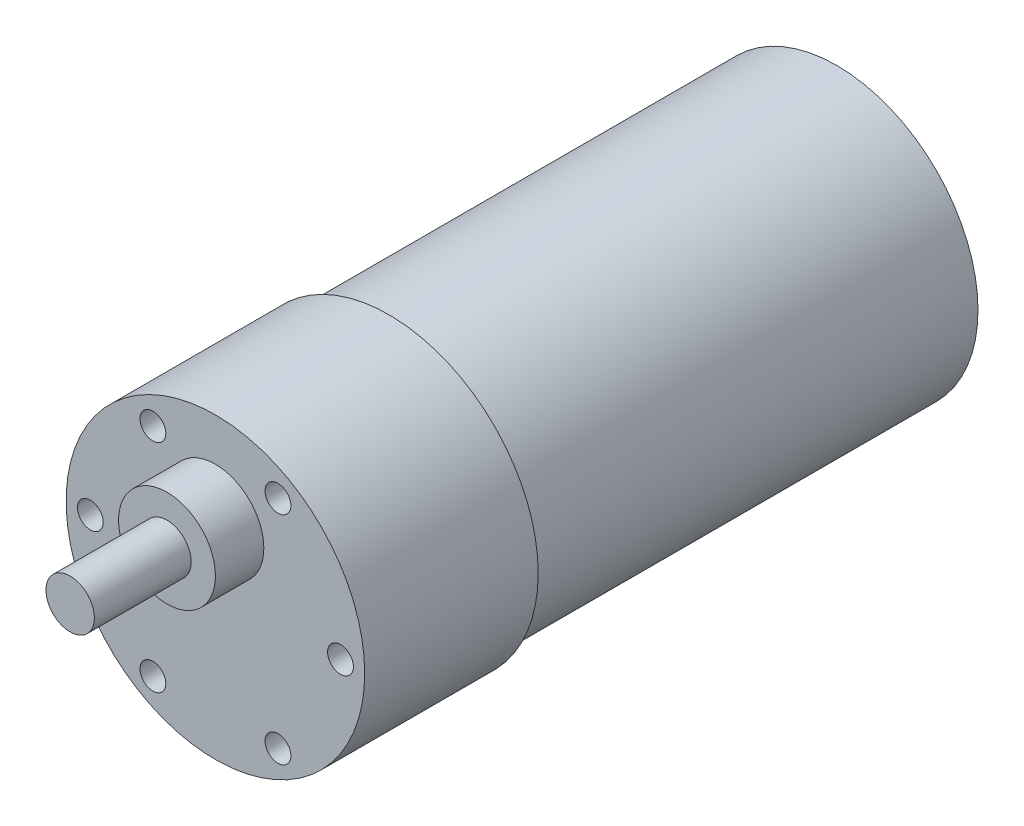
ISO-10303-21;
HEADER;
FILE_DESCRIPTION(('STEP AP214'),'2;1');
FILE_NAME('part.step','',(''),(''),'','','');
FILE_SCHEMA(('AUTOMOTIVE_DESIGN { 1 0 10303 214 1 1 1 1 }'));
ENDSEC;
DATA;
#1=APPLICATION_CONTEXT('core data for automotive mechanical design processes');
#2=APPLICATION_PROTOCOL_DEFINITION('international standard','automotive_design',2000,#1);
#3=PRODUCT_CONTEXT('',#1,'mechanical');
#4=PRODUCT('Part','Part','',(#3));
#5=PRODUCT_RELATED_PRODUCT_CATEGORY('part','',(#4));
#6=PRODUCT_DEFINITION_FORMATION('','',#4);
#7=PRODUCT_DEFINITION_CONTEXT('part definition',#1,'design');
#8=PRODUCT_DEFINITION('design','',#6,#7);
#9=PRODUCT_DEFINITION_SHAPE('','',#8);
#10=(LENGTH_UNIT() NAMED_UNIT(*) SI_UNIT(.MILLI.,.METRE.));
#11=(NAMED_UNIT(*) PLANE_ANGLE_UNIT() SI_UNIT($,.RADIAN.));
#12=(NAMED_UNIT(*) SI_UNIT($,.STERADIAN.) SOLID_ANGLE_UNIT());
#13=UNCERTAINTY_MEASURE_WITH_UNIT(LENGTH_MEASURE(1.E-05),#10,'distance_accuracy_value','');
#14=(GEOMETRIC_REPRESENTATION_CONTEXT(3) GLOBAL_UNCERTAINTY_ASSIGNED_CONTEXT((#13)) GLOBAL_UNIT_ASSIGNED_CONTEXT((#10,
#11,#12)) REPRESENTATION_CONTEXT('',''));
#15=CARTESIAN_POINT('',(0.,0.,0.));
#16=DIRECTION('',(0.,0.,1.));
#17=DIRECTION('',(1.,0.,0.));
#18=AXIS2_PLACEMENT_3D('',#15,#16,#17);
#19=CARTESIAN_POINT('',(0.,0.,-21.5));
#20=DIRECTION('',(0.,0.,1.));
#21=DIRECTION('',(1.,0.,0.));
#22=AXIS2_PLACEMENT_3D('',#19,#20,#21);
#23=CYLINDRICAL_SURFACE('',#22,18.5);
#24=CARTESIAN_POINT('',(0.,0.,-21.5));
#25=DIRECTION('',(0.,0.,1.));
#26=DIRECTION('',(1.,0.,0.));
#27=AXIS2_PLACEMENT_3D('',#24,#25,#26);
#28=CIRCLE('',#27,18.5);
#29=CARTESIAN_POINT('',(18.5,0.,-21.5));
#30=VERTEX_POINT('',#29);
#31=EDGE_CURVE('E51',#30,#30,#28,.T.);
#32=ORIENTED_EDGE('',*,*,#31,.T.);
#33=EDGE_LOOP('',(#32));
#34=FACE_BOUND('',#33,.T.);
#35=CARTESIAN_POINT('',(0.,0.,0.));
#36=DIRECTION('',(0.,0.,1.));
#37=DIRECTION('',(1.,0.,0.));
#38=AXIS2_PLACEMENT_3D('',#35,#36,#37);
#39=CIRCLE('',#38,18.5);
#40=CARTESIAN_POINT('',(18.5,0.,0.));
#41=VERTEX_POINT('',#40);
#42=EDGE_CURVE('E40',#41,#41,#39,.T.);
#43=ORIENTED_EDGE('',*,*,#42,.F.);
#44=EDGE_LOOP('',(#43));
#45=FACE_BOUND('',#44,.T.);
#46=ADVANCED_FACE('F37',(#34,#45),#23,.T.);
#47=CARTESIAN_POINT('',(0.,0.,-21.5));
#48=DIRECTION('',(0.,0.,1.));
#49=DIRECTION('',(1.,0.,0.));
#50=AXIS2_PLACEMENT_3D('',#47,#48,#49);
#51=PLANE('',#50);
#52=CARTESIAN_POINT('',(0.,0.,-21.5));
#53=DIRECTION('',(0.,0.,-1.));
#54=DIRECTION('',(-1.,0.,0.));
#55=AXIS2_PLACEMENT_3D('',#52,#53,#54);
#56=CIRCLE('',#55,17.5);
#57=CARTESIAN_POINT('',(-17.5,0.,-21.5));
#58=VERTEX_POINT('',#57);
#59=EDGE_CURVE('E45',#58,#58,#56,.T.);
#60=ORIENTED_EDGE('',*,*,#59,.F.);
#61=EDGE_LOOP('',(#60));
#62=FACE_BOUND('',#61,.T.);
#63=ORIENTED_EDGE('',*,*,#31,.F.);
#64=EDGE_LOOP('',(#63));
#65=FACE_BOUND('',#64,.T.);
#66=ADVANCED_FACE('F79',(#62,#65),#51,.F.);
#67=CARTESIAN_POINT('',(0.,0.,0.));
#68=DIRECTION('',(0.,0.,1.));
#69=DIRECTION('',(1.,0.,0.));
#70=AXIS2_PLACEMENT_3D('',#67,#68,#69);
#71=PLANE('',#70);
#72=CARTESIAN_POINT('',(-15.4999999999994,-3.63003541003387E-13,0.));
#73=DIRECTION('',(0.,0.,1.));
#74=DIRECTION('',(1.,0.,0.));
#75=AXIS2_PLACEMENT_3D('',#72,#73,#74);
#76=CIRCLE('',#75,1.60000000000038);
#77=CARTESIAN_POINT('',(-13.8999999999991,-3.63003541003387E-13,0.));
#78=VERTEX_POINT('',#77);
#79=EDGE_CURVE('E169',#78,#78,#76,.T.);
#80=ORIENTED_EDGE('',*,*,#79,.F.);
#81=EDGE_LOOP('',(#80));
#82=FACE_BOUND('',#81,.T.);
#83=CARTESIAN_POINT('',(-7.74999999999885,-13.4233937586588,0.));
#84=DIRECTION('',(0.,0.,1.));
#85=DIRECTION('',(1.,0.,0.));
#86=AXIS2_PLACEMENT_3D('',#83,#84,#85);
#87=CIRCLE('',#86,1.60000000000098);
#88=CARTESIAN_POINT('',(-6.14999999999787,-13.4233937586588,0.));
#89=VERTEX_POINT('',#88);
#90=EDGE_CURVE('E183',#89,#89,#87,.T.);
#91=ORIENTED_EDGE('',*,*,#90,.F.);
#92=EDGE_LOOP('',(#91));
#93=FACE_BOUND('',#92,.T.);
#94=CARTESIAN_POINT('',(7.75000000000116,-13.4233937586581,0.));
#95=DIRECTION('',(0.,0.,1.));
#96=DIRECTION('',(1.,0.,0.));
#97=AXIS2_PLACEMENT_3D('',#94,#95,#96);
#98=CIRCLE('',#97,1.60000000000138);
#99=CARTESIAN_POINT('',(9.35000000000254,-13.4233937586581,0.));
#100=VERTEX_POINT('',#99);
#101=EDGE_CURVE('E182',#100,#100,#98,.T.);
#102=ORIENTED_EDGE('',*,*,#101,.F.);
#103=EDGE_LOOP('',(#102));
#104=FACE_BOUND('',#103,.T.);
#105=CARTESIAN_POINT('',(15.5000000000006,1.00398386537682E-12,0.));
#106=DIRECTION('',(0.,0.,1.));
#107=DIRECTION('',(1.,0.,0.));
#108=AXIS2_PLACEMENT_3D('',#105,#106,#107);
#109=CIRCLE('',#108,1.60000000000116);
#110=CARTESIAN_POINT('',(17.1000000000017,1.00398386537682E-12,0.));
#111=VERTEX_POINT('',#110);
#112=EDGE_CURVE('E206',#111,#111,#109,.T.);
#113=ORIENTED_EDGE('',*,*,#112,.F.);
#114=EDGE_LOOP('',(#113));
#115=FACE_BOUND('',#114,.T.);
#116=CARTESIAN_POINT('',(7.74999999999998,13.4233937586595,0.));
#117=DIRECTION('',(0.,0.,1.));
#118=DIRECTION('',(1.,0.,0.));
#119=AXIS2_PLACEMENT_3D('',#116,#117,#118);
#120=CIRCLE('',#119,1.60000000000048);
#121=CARTESIAN_POINT('',(9.35000000000046,13.4233937586595,0.));
#122=VERTEX_POINT('',#121);
#123=EDGE_CURVE('E198',#122,#122,#120,.T.);
#124=ORIENTED_EDGE('',*,*,#123,.F.);
#125=EDGE_LOOP('',(#124));
#126=FACE_BOUND('',#125,.T.);
#127=CARTESIAN_POINT('',(-7.75000000000002,13.4233937586588,0.));
#128=DIRECTION('',(0.,0.,1.));
#129=DIRECTION('',(1.,0.,0.));
#130=AXIS2_PLACEMENT_3D('',#127,#128,#129);
#131=CIRCLE('',#130,1.6);
#132=CARTESIAN_POINT('',(-6.15000000000002,13.4233937586588,0.));
#133=VERTEX_POINT('',#132);
#134=EDGE_CURVE('E190',#133,#133,#131,.T.);
#135=ORIENTED_EDGE('',*,*,#134,.F.);
#136=EDGE_LOOP('',(#135));
#137=FACE_BOUND('',#136,.T.);
#138=CARTESIAN_POINT('',(0.,7.19999999999999,0.));
#139=DIRECTION('',(0.,0.,1.));
#140=DIRECTION('',(1.,0.,0.));
#141=AXIS2_PLACEMENT_3D('',#138,#139,#140);
#142=CIRCLE('',#141,6.);
#143=CARTESIAN_POINT('',(6.,7.19999999999999,0.));
#144=VERTEX_POINT('',#143);
#145=EDGE_CURVE('E62',#144,#144,#142,.T.);
#146=ORIENTED_EDGE('',*,*,#145,.F.);
#147=EDGE_LOOP('',(#146));
#148=FACE_BOUND('',#147,.T.);
#149=ORIENTED_EDGE('',*,*,#42,.T.);
#150=EDGE_LOOP('',(#149));
#151=FACE_BOUND('',#150,.T.);
#152=ADVANCED_FACE('F76',(#82,#93,#104,#115,#126,#137,#148,#151),#71,.T.);
#153=CARTESIAN_POINT('',(0.,0.,-77.));
#154=DIRECTION('',(0.,0.,1.));
#155=DIRECTION('',(1.,0.,0.));
#156=AXIS2_PLACEMENT_3D('',#153,#154,#155);
#157=CYLINDRICAL_SURFACE('',#156,17.5);
#158=CARTESIAN_POINT('',(0.,0.,-77.));
#159=DIRECTION('',(0.,0.,-1.));
#160=DIRECTION('',(-1.,0.,0.));
#161=AXIS2_PLACEMENT_3D('',#158,#159,#160);
#162=CIRCLE('',#161,17.5);
#163=CARTESIAN_POINT('',(-17.5,0.,-77.));
#164=VERTEX_POINT('',#163);
#165=EDGE_CURVE('E61',#164,#164,#162,.T.);
#166=ORIENTED_EDGE('',*,*,#165,.F.);
#167=EDGE_LOOP('',(#166));
#168=FACE_BOUND('',#167,.T.);
#169=ORIENTED_EDGE('',*,*,#59,.T.);
#170=EDGE_LOOP('',(#169));
#171=FACE_BOUND('',#170,.T.);
#172=ADVANCED_FACE('F88',(#168,#171),#157,.T.);
#173=CARTESIAN_POINT('',(0.,0.,-77.));
#174=DIRECTION('',(0.,0.,-1.));
#175=DIRECTION('',(-1.,0.,0.));
#176=AXIS2_PLACEMENT_3D('',#173,#174,#175);
#177=PLANE('',#176);
#178=ORIENTED_EDGE('',*,*,#165,.T.);
#179=EDGE_LOOP('',(#178));
#180=FACE_BOUND('',#179,.T.);
#181=ADVANCED_FACE('F95',(#180),#177,.T.);
#182=CARTESIAN_POINT('',(0.,7.19999999999999,6.));
#183=DIRECTION('',(0.,0.,-1.));
#184=DIRECTION('',(-1.,0.,0.));
#185=AXIS2_PLACEMENT_3D('',#182,#183,#184);
#186=CYLINDRICAL_SURFACE('',#185,6.);
#187=CARTESIAN_POINT('',(0.,7.19999999999999,6.));
#188=DIRECTION('',(0.,0.,1.));
#189=DIRECTION('',(1.,0.,0.));
#190=AXIS2_PLACEMENT_3D('',#187,#188,#189);
#191=CIRCLE('',#190,6.);
#192=CARTESIAN_POINT('',(6.,7.19999999999999,6.));
#193=VERTEX_POINT('',#192);
#194=EDGE_CURVE('E57',#193,#193,#191,.T.);
#195=ORIENTED_EDGE('',*,*,#194,.F.);
#196=EDGE_LOOP('',(#195));
#197=FACE_BOUND('',#196,.T.);
#198=ORIENTED_EDGE('',*,*,#145,.T.);
#199=EDGE_LOOP('',(#198));
#200=FACE_BOUND('',#199,.T.);
#201=ADVANCED_FACE('F99',(#197,#200),#186,.T.);
#202=CARTESIAN_POINT('',(0.,7.19999999999999,6.));
#203=DIRECTION('',(0.,0.,1.));
#204=DIRECTION('',(1.,0.,0.));
#205=AXIS2_PLACEMENT_3D('',#202,#203,#204);
#206=PLANE('',#205);
#207=CARTESIAN_POINT('',(0.,7.19999999999999,6.));
#208=DIRECTION('',(0.,0.,1.));
#209=DIRECTION('',(1.,0.,0.));
#210=AXIS2_PLACEMENT_3D('',#207,#208,#209);
#211=CIRCLE('',#210,3.);
#212=CARTESIAN_POINT('',(3.,7.19999999999999,6.));
#213=VERTEX_POINT('',#212);
#214=EDGE_CURVE('E10',#213,#213,#211,.T.);
#215=ORIENTED_EDGE('',*,*,#214,.F.);
#216=EDGE_LOOP('',(#215));
#217=FACE_BOUND('',#216,.T.);
#218=ORIENTED_EDGE('',*,*,#194,.T.);
#219=EDGE_LOOP('',(#218));
#220=FACE_BOUND('',#219,.T.);
#221=ADVANCED_FACE('F103',(#217,#220),#206,.T.);
#222=CARTESIAN_POINT('',(0.,7.19999999999999,18.));
#223=DIRECTION('',(0.,0.,-1.));
#224=DIRECTION('',(-1.,0.,0.));
#225=AXIS2_PLACEMENT_3D('',#222,#223,#224);
#226=CYLINDRICAL_SURFACE('',#225,3.);
#227=CARTESIAN_POINT('',(0.,7.19999999999999,18.));
#228=DIRECTION('',(0.,0.,1.));
#229=DIRECTION('',(1.,0.,0.));
#230=AXIS2_PLACEMENT_3D('',#227,#228,#229);
#231=CIRCLE('',#230,3.);
#232=CARTESIAN_POINT('',(3.,7.19999999999999,18.));
#233=VERTEX_POINT('',#232);
#234=EDGE_CURVE('E55',#233,#233,#231,.T.);
#235=ORIENTED_EDGE('',*,*,#234,.F.);
#236=EDGE_LOOP('',(#235));
#237=FACE_BOUND('',#236,.T.);
#238=ORIENTED_EDGE('',*,*,#214,.T.);
#239=EDGE_LOOP('',(#238));
#240=FACE_BOUND('',#239,.T.);
#241=ADVANCED_FACE('F107',(#237,#240),#226,.T.);
#242=CARTESIAN_POINT('',(0.,7.19999999999999,18.));
#243=DIRECTION('',(0.,0.,1.));
#244=DIRECTION('',(1.,0.,0.));
#245=AXIS2_PLACEMENT_3D('',#242,#243,#244);
#246=PLANE('',#245);
#247=ORIENTED_EDGE('',*,*,#234,.T.);
#248=EDGE_LOOP('',(#247));
#249=FACE_BOUND('',#248,.T.);
#250=ADVANCED_FACE('F111',(#249),#246,.T.);
#251=CARTESIAN_POINT('',(-7.75000000000002,13.4233937586588,-6.));
#252=DIRECTION('',(0.,0.,1.));
#253=DIRECTION('',(1.,0.,0.));
#254=AXIS2_PLACEMENT_3D('',#251,#252,#253);
#255=CYLINDRICAL_SURFACE('',#254,1.6);
#256=CARTESIAN_POINT('',(-7.75000000000002,13.4233937586588,-6.));
#257=DIRECTION('',(0.,0.,1.));
#258=DIRECTION('',(1.,0.,0.));
#259=AXIS2_PLACEMENT_3D('',#256,#257,#258);
#260=CIRCLE('',#259,1.6);
#261=CARTESIAN_POINT('',(-6.15000000000002,13.4233937586588,-6.));
#262=VERTEX_POINT('',#261);
#263=EDGE_CURVE('E175',#262,#262,#260,.T.);
#264=ORIENTED_EDGE('',*,*,#263,.F.);
#265=EDGE_LOOP('',(#264));
#266=FACE_BOUND('',#265,.T.);
#267=ORIENTED_EDGE('',*,*,#134,.T.);
#268=EDGE_LOOP('',(#267));
#269=FACE_BOUND('',#268,.T.);
#270=ADVANCED_FACE('F115',(#266,#269),#255,.F.);
#271=CARTESIAN_POINT('',(0.,0.,-6.));
#272=DIRECTION('',(0.,0.,1.));
#273=DIRECTION('',(1.,0.,0.));
#274=AXIS2_PLACEMENT_3D('',#271,#272,#273);
#275=PLANE('',#274);
#276=ORIENTED_EDGE('',*,*,#263,.T.);
#277=EDGE_LOOP('',(#276));
#278=FACE_BOUND('',#277,.T.);
#279=ADVANCED_FACE('F138',(#278),#275,.T.);
#280=CARTESIAN_POINT('',(7.74999999999998,13.4233937586595,-6.));
#281=DIRECTION('',(0.,0.,1.));
#282=DIRECTION('',(1.,0.,0.));
#283=AXIS2_PLACEMENT_3D('',#280,#281,#282);
#284=CYLINDRICAL_SURFACE('',#283,1.60000000000048);
#285=CARTESIAN_POINT('',(7.74999999999998,13.4233937586595,-6.));
#286=DIRECTION('',(0.,0.,1.));
#287=DIRECTION('',(1.,0.,0.));
#288=AXIS2_PLACEMENT_3D('',#285,#286,#287);
#289=CIRCLE('',#288,1.60000000000048);
#290=CARTESIAN_POINT('',(9.35000000000046,13.4233937586595,-6.));
#291=VERTEX_POINT('',#290);
#292=EDGE_CURVE('E194',#291,#291,#289,.T.);
#293=ORIENTED_EDGE('',*,*,#292,.F.);
#294=EDGE_LOOP('',(#293));
#295=FACE_BOUND('',#294,.T.);
#296=ORIENTED_EDGE('',*,*,#123,.T.);
#297=EDGE_LOOP('',(#296));
#298=FACE_BOUND('',#297,.T.);
#299=ADVANCED_FACE('F135',(#295,#298),#284,.F.);
#300=CARTESIAN_POINT('',(0.,0.,-6.));
#301=DIRECTION('',(0.,0.,1.));
#302=DIRECTION('',(1.,0.,0.));
#303=AXIS2_PLACEMENT_3D('',#300,#301,#302);
#304=PLANE('',#303);
#305=ORIENTED_EDGE('',*,*,#292,.T.);
#306=EDGE_LOOP('',(#305));
#307=FACE_BOUND('',#306,.T.);
#308=ADVANCED_FACE('F130',(#307),#304,.T.);
#309=CARTESIAN_POINT('',(15.5000000000006,1.00398386537682E-12,-6.));
#310=DIRECTION('',(0.,0.,1.));
#311=DIRECTION('',(1.,0.,0.));
#312=AXIS2_PLACEMENT_3D('',#309,#310,#311);
#313=CYLINDRICAL_SURFACE('',#312,1.60000000000116);
#314=CARTESIAN_POINT('',(15.5000000000006,1.00398386537682E-12,-6.));
#315=DIRECTION('',(0.,0.,1.));
#316=DIRECTION('',(1.,0.,0.));
#317=AXIS2_PLACEMENT_3D('',#314,#315,#316);
#318=CIRCLE('',#317,1.60000000000116);
#319=CARTESIAN_POINT('',(17.1000000000017,1.00398386537682E-12,-6.));
#320=VERTEX_POINT('',#319);
#321=EDGE_CURVE('E202',#320,#320,#318,.T.);
#322=ORIENTED_EDGE('',*,*,#321,.F.);
#323=EDGE_LOOP('',(#322));
#324=FACE_BOUND('',#323,.T.);
#325=ORIENTED_EDGE('',*,*,#112,.T.);
#326=EDGE_LOOP('',(#325));
#327=FACE_BOUND('',#326,.T.);
#328=ADVANCED_FACE('F127',(#324,#327),#313,.F.);
#329=CARTESIAN_POINT('',(0.,0.,-6.));
#330=DIRECTION('',(0.,0.,1.));
#331=DIRECTION('',(1.,0.,0.));
#332=AXIS2_PLACEMENT_3D('',#329,#330,#331);
#333=PLANE('',#332);
#334=ORIENTED_EDGE('',*,*,#321,.T.);
#335=EDGE_LOOP('',(#334));
#336=FACE_BOUND('',#335,.T.);
#337=ADVANCED_FACE('F121',(#336),#333,.T.);
#338=CARTESIAN_POINT('',(7.75000000000116,-13.4233937586581,-6.));
#339=DIRECTION('',(0.,0.,1.));
#340=DIRECTION('',(1.,0.,0.));
#341=AXIS2_PLACEMENT_3D('',#338,#339,#340);
#342=CYLINDRICAL_SURFACE('',#341,1.60000000000138);
#343=CARTESIAN_POINT('',(7.75000000000116,-13.4233937586581,-6.));
#344=DIRECTION('',(0.,0.,1.));
#345=DIRECTION('',(1.,0.,0.));
#346=AXIS2_PLACEMENT_3D('',#343,#344,#345);
#347=CIRCLE('',#346,1.60000000000138);
#348=CARTESIAN_POINT('',(9.35000000000254,-13.4233937586581,-6.));
#349=VERTEX_POINT('',#348);
#350=EDGE_CURVE('E210',#349,#349,#347,.T.);
#351=ORIENTED_EDGE('',*,*,#350,.F.);
#352=EDGE_LOOP('',(#351));
#353=FACE_BOUND('',#352,.T.);
#354=ORIENTED_EDGE('',*,*,#101,.T.);
#355=EDGE_LOOP('',(#354));
#356=FACE_BOUND('',#355,.T.);
#357=ADVANCED_FACE('F117',(#353,#356),#342,.F.);
#358=CARTESIAN_POINT('',(0.,0.,-6.));
#359=DIRECTION('',(0.,0.,1.));
#360=DIRECTION('',(1.,0.,0.));
#361=AXIS2_PLACEMENT_3D('',#358,#359,#360);
#362=PLANE('',#361);
#363=ORIENTED_EDGE('',*,*,#350,.T.);
#364=EDGE_LOOP('',(#363));
#365=FACE_BOUND('',#364,.T.);
#366=ADVANCED_FACE('F120',(#365),#362,.T.);
#367=CARTESIAN_POINT('',(-7.74999999999885,-13.4233937586588,-6.));
#368=DIRECTION('',(0.,0.,1.));
#369=DIRECTION('',(1.,0.,0.));
#370=AXIS2_PLACEMENT_3D('',#367,#368,#369);
#371=CYLINDRICAL_SURFACE('',#370,1.60000000000098);
#372=CARTESIAN_POINT('',(-7.74999999999885,-13.4233937586588,-6.));
#373=DIRECTION('',(0.,0.,1.));
#374=DIRECTION('',(1.,0.,0.));
#375=AXIS2_PLACEMENT_3D('',#372,#373,#374);
#376=CIRCLE('',#375,1.60000000000098);
#377=CARTESIAN_POINT('',(-6.14999999999787,-13.4233937586588,-6.));
#378=VERTEX_POINT('',#377);
#379=EDGE_CURVE('E178',#378,#378,#376,.T.);
#380=ORIENTED_EDGE('',*,*,#379,.F.);
#381=EDGE_LOOP('',(#380));
#382=FACE_BOUND('',#381,.T.);
#383=ORIENTED_EDGE('',*,*,#90,.T.);
#384=EDGE_LOOP('',(#383));
#385=FACE_BOUND('',#384,.T.);
#386=ADVANCED_FACE('F125',(#382,#385),#371,.F.);
#387=CARTESIAN_POINT('',(0.,0.,-6.));
#388=DIRECTION('',(0.,0.,1.));
#389=DIRECTION('',(1.,0.,0.));
#390=AXIS2_PLACEMENT_3D('',#387,#388,#389);
#391=PLANE('',#390);
#392=ORIENTED_EDGE('',*,*,#379,.T.);
#393=EDGE_LOOP('',(#392));
#394=FACE_BOUND('',#393,.T.);
#395=ADVANCED_FACE('F151',(#394),#391,.T.);
#396=CARTESIAN_POINT('',(-15.4999999999994,-3.63003541003387E-13,-6.));
#397=DIRECTION('',(0.,0.,1.));
#398=DIRECTION('',(1.,0.,0.));
#399=AXIS2_PLACEMENT_3D('',#396,#397,#398);
#400=CYLINDRICAL_SURFACE('',#399,1.60000000000038);
#401=CARTESIAN_POINT('',(-15.4999999999994,-3.63003541003387E-13,-6.));
#402=DIRECTION('',(0.,0.,1.));
#403=DIRECTION('',(1.,0.,0.));
#404=AXIS2_PLACEMENT_3D('',#401,#402,#403);
#405=CIRCLE('',#404,1.60000000000038);
#406=CARTESIAN_POINT('',(-13.8999999999991,-3.63003541003387E-13,-6.));
#407=VERTEX_POINT('',#406);
#408=EDGE_CURVE('E167',#407,#407,#405,.T.);
#409=ORIENTED_EDGE('',*,*,#408,.F.);
#410=EDGE_LOOP('',(#409));
#411=FACE_BOUND('',#410,.T.);
#412=ORIENTED_EDGE('',*,*,#79,.T.);
#413=EDGE_LOOP('',(#412));
#414=FACE_BOUND('',#413,.T.);
#415=ADVANCED_FACE('F155',(#411,#414),#400,.F.);
#416=CARTESIAN_POINT('',(0.,0.,-6.));
#417=DIRECTION('',(0.,0.,1.));
#418=DIRECTION('',(1.,0.,0.));
#419=AXIS2_PLACEMENT_3D('',#416,#417,#418);
#420=PLANE('',#419);
#421=ORIENTED_EDGE('',*,*,#408,.T.);
#422=EDGE_LOOP('',(#421));
#423=FACE_BOUND('',#422,.T.);
#424=ADVANCED_FACE('F159',(#423),#420,.T.);
#425=CLOSED_SHELL('',(#46,#66,#152,#172,#181,#201,#221,#241,#250,#270,#279,#299,#308,#328,#337,
#357,#366,#386,#395,#415,#424));
#426=MANIFOLD_SOLID_BREP('B2',#425);
#427=ADVANCED_BREP_SHAPE_REPRESENTATION('',(#18,#426),#14);
#428=SHAPE_DEFINITION_REPRESENTATION(#9,#427);
ENDSEC;
END-ISO-10303-21;
